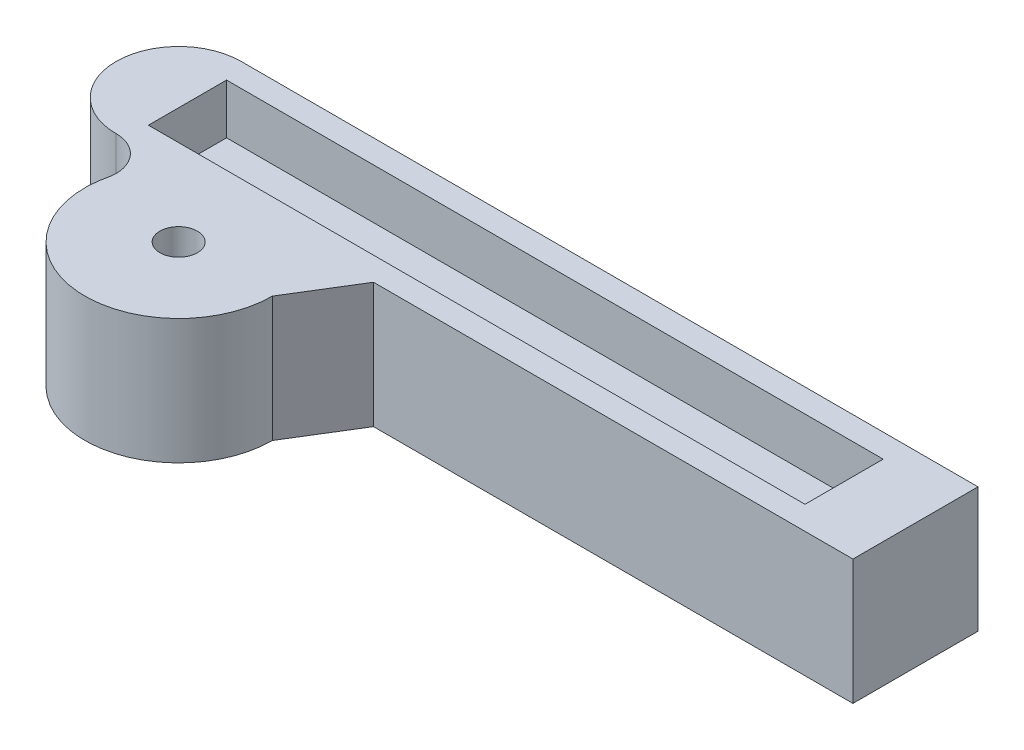
ISO-10303-21;
HEADER;
FILE_DESCRIPTION(('STEP AP214'),'2;1');
FILE_NAME('part.step','',(''),(''),'','','');
FILE_SCHEMA(('AUTOMOTIVE_DESIGN { 1 0 10303 214 1 1 1 1 }'));
ENDSEC;
DATA;
#1=APPLICATION_CONTEXT('core data for automotive mechanical design processes');
#2=APPLICATION_PROTOCOL_DEFINITION('international standard','automotive_design',2000,#1);
#3=PRODUCT_CONTEXT('',#1,'mechanical');
#4=PRODUCT('Part','Part','',(#3));
#5=PRODUCT_RELATED_PRODUCT_CATEGORY('part','',(#4));
#6=PRODUCT_DEFINITION_FORMATION('','',#4);
#7=PRODUCT_DEFINITION_CONTEXT('part definition',#1,'design');
#8=PRODUCT_DEFINITION('design','',#6,#7);
#9=PRODUCT_DEFINITION_SHAPE('','',#8);
#10=(LENGTH_UNIT() NAMED_UNIT(*) SI_UNIT(.MILLI.,.METRE.));
#11=(NAMED_UNIT(*) PLANE_ANGLE_UNIT() SI_UNIT($,.RADIAN.));
#12=(NAMED_UNIT(*) SI_UNIT($,.STERADIAN.) SOLID_ANGLE_UNIT());
#13=UNCERTAINTY_MEASURE_WITH_UNIT(LENGTH_MEASURE(1.E-05),#10,'distance_accuracy_value','');
#14=(GEOMETRIC_REPRESENTATION_CONTEXT(3) GLOBAL_UNCERTAINTY_ASSIGNED_CONTEXT((#13)) GLOBAL_UNIT_ASSIGNED_CONTEXT((#10,
#11,#12)) REPRESENTATION_CONTEXT('',''));
#15=CARTESIAN_POINT('',(0.,0.,0.));
#16=DIRECTION('',(0.,0.,1.));
#17=DIRECTION('',(1.,0.,0.));
#18=AXIS2_PLACEMENT_3D('',#15,#16,#17);
#19=CARTESIAN_POINT('',(-20.,20.,-4.47293048602591));
#20=DIRECTION('',(0.,-1.,0.));
#21=DIRECTION('',(0.,0.,-1.));
#22=AXIS2_PLACEMENT_3D('',#19,#20,#21);
#23=PLANE('',#22);
#24=DIRECTION('',(-1.,0.,0.));
#25=VECTOR('',#24,1.);
#26=CARTESIAN_POINT('',(-18.585,20.,-26.25));
#27=LINE('',#26,#25);
#28=CARTESIAN_POINT('',(86.415,20.,-26.25));
#29=VERTEX_POINT('',#28);
#30=CARTESIAN_POINT('',(-18.585,20.,-26.25));
#31=VERTEX_POINT('',#30);
#32=EDGE_CURVE('E172',#29,#31,#27,.T.);
#33=ORIENTED_EDGE('',*,*,#32,.F.);
#34=DIRECTION('',(0.,0.,-1.));
#35=VECTOR('',#34,1.);
#36=CARTESIAN_POINT('',(86.415,20.,-26.25));
#37=LINE('',#36,#35);
#38=CARTESIAN_POINT('',(86.415,20.,-13.75));
#39=VERTEX_POINT('',#38);
#40=EDGE_CURVE('E51',#39,#29,#37,.T.);
#41=ORIENTED_EDGE('',*,*,#40,.F.);
#42=DIRECTION('',(1.,0.,0.));
#43=VECTOR('',#42,1.);
#44=CARTESIAN_POINT('',(-18.585,20.,-13.75));
#45=LINE('',#44,#43);
#46=CARTESIAN_POINT('',(-18.585,20.,-13.75));
#47=VERTEX_POINT('',#46);
#48=EDGE_CURVE('E163',#47,#39,#45,.T.);
#49=ORIENTED_EDGE('',*,*,#48,.F.);
#50=DIRECTION('',(0.,0.,1.));
#51=VECTOR('',#50,1.);
#52=CARTESIAN_POINT('',(-18.585,20.,-26.25));
#53=LINE('',#52,#51);
#54=EDGE_CURVE('E166',#31,#47,#53,.T.);
#55=ORIENTED_EDGE('',*,*,#54,.F.);
#56=EDGE_LOOP('',(#33,#41,#49,#55));
#57=FACE_BOUND('',#56,.T.);
#58=CARTESIAN_POINT('',(-20.,20.,-4.47293048602591));
#59=DIRECTION('',(0.,-1.,0.));
#60=DIRECTION('',(0.,0.,-1.));
#61=AXIS2_PLACEMENT_3D('',#58,#59,#60);
#62=CIRCLE('',#61,5.52706951397407);
#63=CARTESIAN_POINT('',(-20.,20.,-10.));
#64=VERTEX_POINT('',#63);
#65=CARTESIAN_POINT('',(-14.5171381657611,20.,-3.77527475506122));
#66=VERTEX_POINT('',#65);
#67=EDGE_CURVE('E218',#64,#66,#62,.T.);
#68=ORIENTED_EDGE('',*,*,#67,.T.);
#69=CARTESIAN_POINT('',(0.,20.,0.));
#70=DIRECTION('',(0.,1.,0.));
#71=DIRECTION('',(0.,0.,1.));
#72=AXIS2_PLACEMENT_3D('',#69,#70,#71);
#73=CIRCLE('',#72,15.);
#74=CARTESIAN_POINT('',(15.,20.,0.));
#75=VERTEX_POINT('',#74);
#76=EDGE_CURVE('E221',#66,#75,#73,.T.);
#77=ORIENTED_EDGE('',*,*,#76,.T.);
#78=DIRECTION('',(0.524508299549326,0.,-0.85140533455216));
#79=VECTOR('',#78,1.);
#80=CARTESIAN_POINT('',(15.,20.,0.));
#81=LINE('',#80,#79);
#82=CARTESIAN_POINT('',(21.1605005073784,20.,-9.99999999999998));
#83=VERTEX_POINT('',#82);
#84=EDGE_CURVE('E224',#75,#83,#81,.T.);
#85=ORIENTED_EDGE('',*,*,#84,.T.);
#86=DIRECTION('',(1.,0.,0.));
#87=VECTOR('',#86,1.);
#88=CARTESIAN_POINT('',(97.83,20.,-10.));
#89=LINE('',#88,#87);
#90=CARTESIAN_POINT('',(97.83,20.,-10.));
#91=VERTEX_POINT('',#90);
#92=EDGE_CURVE('E226',#83,#91,#89,.T.);
#93=ORIENTED_EDGE('',*,*,#92,.T.);
#94=DIRECTION('',(0.,0.,-1.));
#95=VECTOR('',#94,1.);
#96=CARTESIAN_POINT('',(97.83,20.,-30.));
#97=LINE('',#96,#95);
#98=CARTESIAN_POINT('',(97.83,20.,-30.));
#99=VERTEX_POINT('',#98);
#100=EDGE_CURVE('E228',#91,#99,#97,.T.);
#101=ORIENTED_EDGE('',*,*,#100,.T.);
#102=DIRECTION('',(-1.,0.,0.));
#103=VECTOR('',#102,1.);
#104=CARTESIAN_POINT('',(-20.,20.,-30.));
#105=LINE('',#104,#103);
#106=CARTESIAN_POINT('',(-20.,20.,-30.));
#107=VERTEX_POINT('',#106);
#108=EDGE_CURVE('E230',#99,#107,#105,.T.);
#109=ORIENTED_EDGE('',*,*,#108,.T.);
#110=CARTESIAN_POINT('',(-20.,20.,-20.));
#111=DIRECTION('',(0.,1.,0.));
#112=DIRECTION('',(0.,0.,-1.));
#113=AXIS2_PLACEMENT_3D('',#110,#111,#112);
#114=CIRCLE('',#113,10.);
#115=EDGE_CURVE('E232',#107,#64,#114,.T.);
#116=ORIENTED_EDGE('',*,*,#115,.T.);
#117=EDGE_LOOP('',(#68,#77,#85,#93,#101,#109,#116));
#118=FACE_BOUND('',#117,.T.);
#119=CARTESIAN_POINT('',(0.,20.,0.));
#120=DIRECTION('',(0.,1.,0.));
#121=DIRECTION('',(0.,0.,1.));
#122=AXIS2_PLACEMENT_3D('',#119,#120,#121);
#123=CIRCLE('',#122,3.);
#124=CARTESIAN_POINT('',(0.,20.,3.));
#125=VERTEX_POINT('',#124);
#126=EDGE_CURVE('E212',#125,#125,#123,.T.);
#127=ORIENTED_EDGE('',*,*,#126,.F.);
#128=EDGE_LOOP('',(#127));
#129=FACE_BOUND('',#128,.T.);
#130=ADVANCED_FACE('F36',(#57,#118,#129),#23,.F.);
#131=CARTESIAN_POINT('',(-20.,0.,-4.47293048602591));
#132=DIRECTION('',(0.,-1.,0.));
#133=DIRECTION('',(0.,0.,-1.));
#134=AXIS2_PLACEMENT_3D('',#131,#132,#133);
#135=PLANE('',#134);
#136=DIRECTION('',(0.,0.,1.));
#137=VECTOR('',#136,1.);
#138=CARTESIAN_POINT('',(86.415,0.,-14.));
#139=LINE('',#138,#137);
#140=CARTESIAN_POINT('',(86.415,0.,-26.5));
#141=VERTEX_POINT('',#140);
#142=CARTESIAN_POINT('',(86.415,0.,-14.));
#143=VERTEX_POINT('',#142);
#144=EDGE_CURVE('E59',#141,#143,#139,.T.);
#145=ORIENTED_EDGE('',*,*,#144,.F.);
#146=DIRECTION('',(1.,0.,0.));
#147=VECTOR('',#146,1.);
#148=CARTESIAN_POINT('',(-18.585,0.,-26.5));
#149=LINE('',#148,#147);
#150=CARTESIAN_POINT('',(-18.585,0.,-26.5));
#151=VERTEX_POINT('',#150);
#152=EDGE_CURVE('E185',#151,#141,#149,.T.);
#153=ORIENTED_EDGE('',*,*,#152,.F.);
#154=DIRECTION('',(0.,0.,-1.));
#155=VECTOR('',#154,1.);
#156=CARTESIAN_POINT('',(-18.585,0.,-14.));
#157=LINE('',#156,#155);
#158=CARTESIAN_POINT('',(-18.585,0.,-14.));
#159=VERTEX_POINT('',#158);
#160=EDGE_CURVE('E199',#159,#151,#157,.T.);
#161=ORIENTED_EDGE('',*,*,#160,.F.);
#162=DIRECTION('',(-1.,0.,0.));
#163=VECTOR('',#162,1.);
#164=CARTESIAN_POINT('',(-18.585,0.,-14.));
#165=LINE('',#164,#163);
#166=EDGE_CURVE('E196',#143,#159,#165,.T.);
#167=ORIENTED_EDGE('',*,*,#166,.F.);
#168=EDGE_LOOP('',(#145,#153,#161,#167));
#169=FACE_BOUND('',#168,.T.);
#170=CARTESIAN_POINT('',(-20.,0.,-4.47293048602591));
#171=DIRECTION('',(0.,-1.,0.));
#172=DIRECTION('',(0.,0.,-1.));
#173=AXIS2_PLACEMENT_3D('',#170,#171,#172);
#174=CIRCLE('',#173,5.52706951397407);
#175=CARTESIAN_POINT('',(-20.,0.,-10.));
#176=VERTEX_POINT('',#175);
#177=CARTESIAN_POINT('',(-14.5171381657611,0.,-3.77527475506122));
#178=VERTEX_POINT('',#177);
#179=EDGE_CURVE('E215',#176,#178,#174,.T.);
#180=ORIENTED_EDGE('',*,*,#179,.F.);
#181=CARTESIAN_POINT('',(-20.,0.,-20.));
#182=DIRECTION('',(0.,1.,0.));
#183=DIRECTION('',(0.,0.,-1.));
#184=AXIS2_PLACEMENT_3D('',#181,#182,#183);
#185=CIRCLE('',#184,10.);
#186=CARTESIAN_POINT('',(-20.,0.,-30.));
#187=VERTEX_POINT('',#186);
#188=EDGE_CURVE('E222',#187,#176,#185,.T.);
#189=ORIENTED_EDGE('',*,*,#188,.F.);
#190=DIRECTION('',(-1.,0.,0.));
#191=VECTOR('',#190,1.);
#192=CARTESIAN_POINT('',(-20.,0.,-30.));
#193=LINE('',#192,#191);
#194=CARTESIAN_POINT('',(97.83,0.,-30.));
#195=VERTEX_POINT('',#194);
#196=EDGE_CURVE('E245',#195,#187,#193,.T.);
#197=ORIENTED_EDGE('',*,*,#196,.F.);
#198=DIRECTION('',(0.,0.,-1.));
#199=VECTOR('',#198,1.);
#200=CARTESIAN_POINT('',(97.83,0.,-30.));
#201=LINE('',#200,#199);
#202=CARTESIAN_POINT('',(97.83,0.,-10.));
#203=VERTEX_POINT('',#202);
#204=EDGE_CURVE('E243',#203,#195,#201,.T.);
#205=ORIENTED_EDGE('',*,*,#204,.F.);
#206=DIRECTION('',(1.,0.,0.));
#207=VECTOR('',#206,1.);
#208=CARTESIAN_POINT('',(97.83,0.,-10.));
#209=LINE('',#208,#207);
#210=CARTESIAN_POINT('',(21.1605005073784,0.,-9.99999999999998));
#211=VERTEX_POINT('',#210);
#212=EDGE_CURVE('E241',#211,#203,#209,.T.);
#213=ORIENTED_EDGE('',*,*,#212,.F.);
#214=DIRECTION('',(0.524508299549326,0.,-0.85140533455216));
#215=VECTOR('',#214,1.);
#216=CARTESIAN_POINT('',(15.,0.,0.));
#217=LINE('',#216,#215);
#218=CARTESIAN_POINT('',(15.,0.,0.));
#219=VERTEX_POINT('',#218);
#220=EDGE_CURVE('E239',#219,#211,#217,.T.);
#221=ORIENTED_EDGE('',*,*,#220,.F.);
#222=CARTESIAN_POINT('',(0.,0.,0.));
#223=DIRECTION('',(0.,1.,0.));
#224=DIRECTION('',(0.,0.,1.));
#225=AXIS2_PLACEMENT_3D('',#222,#223,#224);
#226=CIRCLE('',#225,15.);
#227=EDGE_CURVE('E237',#178,#219,#226,.T.);
#228=ORIENTED_EDGE('',*,*,#227,.F.);
#229=EDGE_LOOP('',(#180,#189,#197,#205,#213,#221,#228));
#230=FACE_BOUND('',#229,.T.);
#231=CARTESIAN_POINT('',(0.,0.,0.));
#232=DIRECTION('',(0.,1.,0.));
#233=DIRECTION('',(0.,0.,1.));
#234=AXIS2_PLACEMENT_3D('',#231,#232,#233);
#235=CIRCLE('',#234,3.);
#236=CARTESIAN_POINT('',(0.,0.,3.));
#237=VERTEX_POINT('',#236);
#238=EDGE_CURVE('E206',#237,#237,#235,.T.);
#239=ORIENTED_EDGE('',*,*,#238,.T.);
#240=EDGE_LOOP('',(#239));
#241=FACE_BOUND('',#240,.T.);
#242=ADVANCED_FACE('F272',(#169,#230,#241),#135,.T.);
#243=CARTESIAN_POINT('',(-20.,20.,-4.47293048602591));
#244=DIRECTION('',(0.,-1.,0.));
#245=DIRECTION('',(0.,0.,-1.));
#246=AXIS2_PLACEMENT_3D('',#243,#244,#245);
#247=CYLINDRICAL_SURFACE('',#246,5.52706951397407);
#248=ORIENTED_EDGE('',*,*,#179,.T.);
#249=DIRECTION('',(0.,-1.,0.));
#250=VECTOR('',#249,1.);
#251=CARTESIAN_POINT('',(-14.5171381657611,20.,-3.77527475506122));
#252=LINE('',#251,#250);
#253=EDGE_CURVE('E11',#66,#178,#252,.T.);
#254=ORIENTED_EDGE('',*,*,#253,.F.);
#255=ORIENTED_EDGE('',*,*,#67,.F.);
#256=DIRECTION('',(0.,-1.,0.));
#257=VECTOR('',#256,1.);
#258=CARTESIAN_POINT('',(-20.,20.,-10.));
#259=LINE('',#258,#257);
#260=EDGE_CURVE('E234',#64,#176,#259,.T.);
#261=ORIENTED_EDGE('',*,*,#260,.T.);
#262=EDGE_LOOP('',(#248,#254,#255,#261));
#263=FACE_BOUND('',#262,.T.);
#264=ADVANCED_FACE('F38',(#263),#247,.F.);
#265=CARTESIAN_POINT('',(0.,20.,0.));
#266=DIRECTION('',(0.,-1.,0.));
#267=DIRECTION('',(0.,0.,-1.));
#268=AXIS2_PLACEMENT_3D('',#265,#266,#267);
#269=CYLINDRICAL_SURFACE('',#268,15.);
#270=ORIENTED_EDGE('',*,*,#227,.T.);
#271=DIRECTION('',(0.,-1.,0.));
#272=VECTOR('',#271,1.);
#273=CARTESIAN_POINT('',(15.,20.,0.));
#274=LINE('',#273,#272);
#275=EDGE_CURVE('E44',#75,#219,#274,.T.);
#276=ORIENTED_EDGE('',*,*,#275,.F.);
#277=ORIENTED_EDGE('',*,*,#76,.F.);
#278=ORIENTED_EDGE('',*,*,#253,.T.);
#279=EDGE_LOOP('',(#270,#276,#277,#278));
#280=FACE_BOUND('',#279,.T.);
#281=ADVANCED_FACE('F290',(#280),#269,.T.);
#282=CARTESIAN_POINT('',(15.,20.,0.));
#283=DIRECTION('',(-0.85140533455216,0.,-0.524508299549326));
#284=DIRECTION('',(-0.524508299549326,0.,0.85140533455216));
#285=AXIS2_PLACEMENT_3D('',#282,#283,#284);
#286=PLANE('',#285);
#287=ORIENTED_EDGE('',*,*,#220,.T.);
#288=DIRECTION('',(0.,-1.,0.));
#289=VECTOR('',#288,1.);
#290=CARTESIAN_POINT('',(21.1605005073784,20.,-9.99999999999998));
#291=LINE('',#290,#289);
#292=EDGE_CURVE('E259',#83,#211,#291,.T.);
#293=ORIENTED_EDGE('',*,*,#292,.F.);
#294=ORIENTED_EDGE('',*,*,#84,.F.);
#295=ORIENTED_EDGE('',*,*,#275,.T.);
#296=EDGE_LOOP('',(#287,#293,#294,#295));
#297=FACE_BOUND('',#296,.T.);
#298=ADVANCED_FACE('F266',(#297),#286,.F.);
#299=CARTESIAN_POINT('',(97.83,20.,-10.));
#300=DIRECTION('',(0.,0.,-1.));
#301=DIRECTION('',(-1.,0.,0.));
#302=AXIS2_PLACEMENT_3D('',#299,#300,#301);
#303=PLANE('',#302);
#304=ORIENTED_EDGE('',*,*,#212,.T.);
#305=DIRECTION('',(0.,-1.,0.));
#306=VECTOR('',#305,1.);
#307=CARTESIAN_POINT('',(97.83,20.,-10.));
#308=LINE('',#307,#306);
#309=EDGE_CURVE('E256',#91,#203,#308,.T.);
#310=ORIENTED_EDGE('',*,*,#309,.F.);
#311=ORIENTED_EDGE('',*,*,#92,.F.);
#312=ORIENTED_EDGE('',*,*,#292,.T.);
#313=EDGE_LOOP('',(#304,#310,#311,#312));
#314=FACE_BOUND('',#313,.T.);
#315=ADVANCED_FACE('F278',(#314),#303,.F.);
#316=CARTESIAN_POINT('',(97.83,20.,-30.));
#317=DIRECTION('',(-1.,0.,0.));
#318=DIRECTION('',(0.,0.,1.));
#319=AXIS2_PLACEMENT_3D('',#316,#317,#318);
#320=PLANE('',#319);
#321=ORIENTED_EDGE('',*,*,#204,.T.);
#322=DIRECTION('',(0.,-1.,0.));
#323=VECTOR('',#322,1.);
#324=CARTESIAN_POINT('',(97.83,20.,-30.));
#325=LINE('',#324,#323);
#326=EDGE_CURVE('E253',#99,#195,#325,.T.);
#327=ORIENTED_EDGE('',*,*,#326,.F.);
#328=ORIENTED_EDGE('',*,*,#100,.F.);
#329=ORIENTED_EDGE('',*,*,#309,.T.);
#330=EDGE_LOOP('',(#321,#327,#328,#329));
#331=FACE_BOUND('',#330,.T.);
#332=ADVANCED_FACE('F282',(#331),#320,.F.);
#333=CARTESIAN_POINT('',(-20.,20.,-30.));
#334=DIRECTION('',(0.,0.,1.));
#335=DIRECTION('',(1.,0.,0.));
#336=AXIS2_PLACEMENT_3D('',#333,#334,#335);
#337=PLANE('',#336);
#338=ORIENTED_EDGE('',*,*,#196,.T.);
#339=DIRECTION('',(0.,-1.,0.));
#340=VECTOR('',#339,1.);
#341=CARTESIAN_POINT('',(-20.,20.,-30.));
#342=LINE('',#341,#340);
#343=EDGE_CURVE('E250',#107,#187,#342,.T.);
#344=ORIENTED_EDGE('',*,*,#343,.F.);
#345=ORIENTED_EDGE('',*,*,#108,.F.);
#346=ORIENTED_EDGE('',*,*,#326,.T.);
#347=EDGE_LOOP('',(#338,#344,#345,#346));
#348=FACE_BOUND('',#347,.T.);
#349=ADVANCED_FACE('F298',(#348),#337,.F.);
#350=CARTESIAN_POINT('',(-20.,20.,-20.));
#351=DIRECTION('',(0.,-1.,0.));
#352=DIRECTION('',(0.,0.,-1.));
#353=AXIS2_PLACEMENT_3D('',#350,#351,#352);
#354=CYLINDRICAL_SURFACE('',#353,10.);
#355=ORIENTED_EDGE('',*,*,#188,.T.);
#356=ORIENTED_EDGE('',*,*,#260,.F.);
#357=ORIENTED_EDGE('',*,*,#115,.F.);
#358=ORIENTED_EDGE('',*,*,#343,.T.);
#359=EDGE_LOOP('',(#355,#356,#357,#358));
#360=FACE_BOUND('',#359,.T.);
#361=ADVANCED_FACE('F295',(#360),#354,.T.);
#362=CARTESIAN_POINT('',(0.,20.,0.));
#363=DIRECTION('',(0.,-1.,0.));
#364=DIRECTION('',(0.,0.,-1.));
#365=AXIS2_PLACEMENT_3D('',#362,#363,#364);
#366=CYLINDRICAL_SURFACE('',#365,3.);
#367=ORIENTED_EDGE('',*,*,#126,.T.);
#368=EDGE_LOOP('',(#367));
#369=FACE_BOUND('',#368,.T.);
#370=ORIENTED_EDGE('',*,*,#238,.F.);
#371=EDGE_LOOP('',(#370));
#372=FACE_BOUND('',#371,.T.);
#373=ADVANCED_FACE('F305',(#369,#372),#366,.F.);
#374=CARTESIAN_POINT('',(86.415,8.,-14.));
#375=DIRECTION('',(1.,0.,0.));
#376=DIRECTION('',(0.,0.,-1.));
#377=AXIS2_PLACEMENT_3D('',#374,#375,#376);
#378=PLANE('',#377);
#379=ORIENTED_EDGE('',*,*,#144,.T.);
#380=DIRECTION('',(0.,-1.,0.));
#381=VECTOR('',#380,1.);
#382=CARTESIAN_POINT('',(86.415,8.,-14.));
#383=LINE('',#382,#381);
#384=CARTESIAN_POINT('',(86.415,8.,-14.));
#385=VERTEX_POINT('',#384);
#386=EDGE_CURVE('E194',#385,#143,#383,.T.);
#387=ORIENTED_EDGE('',*,*,#386,.F.);
#388=DIRECTION('',(0.,0.,1.));
#389=VECTOR('',#388,1.);
#390=CARTESIAN_POINT('',(86.415,8.,-14.));
#391=LINE('',#390,#389);
#392=CARTESIAN_POINT('',(86.415,8.,-26.5));
#393=VERTEX_POINT('',#392);
#394=EDGE_CURVE('E181',#393,#385,#391,.T.);
#395=ORIENTED_EDGE('',*,*,#394,.F.);
#396=DIRECTION('',(0.,-1.,0.));
#397=VECTOR('',#396,1.);
#398=CARTESIAN_POINT('',(86.415,8.,-26.5));
#399=LINE('',#398,#397);
#400=EDGE_CURVE('E204',#393,#141,#399,.T.);
#401=ORIENTED_EDGE('',*,*,#400,.T.);
#402=EDGE_LOOP('',(#379,#387,#395,#401));
#403=FACE_BOUND('',#402,.T.);
#404=ADVANCED_FACE('F319',(#403),#378,.F.);
#405=CARTESIAN_POINT('',(-18.585,8.,-26.5));
#406=DIRECTION('',(0.,0.,-1.));
#407=DIRECTION('',(-1.,0.,0.));
#408=AXIS2_PLACEMENT_3D('',#405,#406,#407);
#409=PLANE('',#408);
#410=ORIENTED_EDGE('',*,*,#152,.T.);
#411=ORIENTED_EDGE('',*,*,#400,.F.);
#412=DIRECTION('',(1.,0.,0.));
#413=VECTOR('',#412,1.);
#414=CARTESIAN_POINT('',(-18.585,8.,-26.5));
#415=LINE('',#414,#413);
#416=CARTESIAN_POINT('',(-18.585,8.,-26.5));
#417=VERTEX_POINT('',#416);
#418=EDGE_CURVE('E191',#417,#393,#415,.T.);
#419=ORIENTED_EDGE('',*,*,#418,.F.);
#420=DIRECTION('',(0.,-1.,0.));
#421=VECTOR('',#420,1.);
#422=CARTESIAN_POINT('',(-18.585,8.,-26.5));
#423=LINE('',#422,#421);
#424=EDGE_CURVE('E207',#417,#151,#423,.T.);
#425=ORIENTED_EDGE('',*,*,#424,.T.);
#426=EDGE_LOOP('',(#410,#411,#419,#425));
#427=FACE_BOUND('',#426,.T.);
#428=ADVANCED_FACE('F323',(#427),#409,.F.);
#429=CARTESIAN_POINT('',(-18.585,8.,-14.));
#430=DIRECTION('',(-1.,0.,0.));
#431=DIRECTION('',(0.,0.,1.));
#432=AXIS2_PLACEMENT_3D('',#429,#430,#431);
#433=PLANE('',#432);
#434=ORIENTED_EDGE('',*,*,#160,.T.);
#435=ORIENTED_EDGE('',*,*,#424,.F.);
#436=DIRECTION('',(0.,0.,-1.));
#437=VECTOR('',#436,1.);
#438=CARTESIAN_POINT('',(-18.585,8.,-14.));
#439=LINE('',#438,#437);
#440=CARTESIAN_POINT('',(-18.585,8.,-14.));
#441=VERTEX_POINT('',#440);
#442=EDGE_CURVE('E188',#441,#417,#439,.T.);
#443=ORIENTED_EDGE('',*,*,#442,.F.);
#444=DIRECTION('',(0.,-1.,0.));
#445=VECTOR('',#444,1.);
#446=CARTESIAN_POINT('',(-18.585,8.,-14.));
#447=LINE('',#446,#445);
#448=EDGE_CURVE('E209',#441,#159,#447,.T.);
#449=ORIENTED_EDGE('',*,*,#448,.T.);
#450=EDGE_LOOP('',(#434,#435,#443,#449));
#451=FACE_BOUND('',#450,.T.);
#452=ADVANCED_FACE('F328',(#451),#433,.F.);
#453=CARTESIAN_POINT('',(-18.585,8.,-14.));
#454=DIRECTION('',(0.,0.,1.));
#455=DIRECTION('',(1.,0.,0.));
#456=AXIS2_PLACEMENT_3D('',#453,#454,#455);
#457=PLANE('',#456);
#458=ORIENTED_EDGE('',*,*,#166,.T.);
#459=ORIENTED_EDGE('',*,*,#448,.F.);
#460=DIRECTION('',(-1.,0.,0.));
#461=VECTOR('',#460,1.);
#462=CARTESIAN_POINT('',(-18.585,8.,-14.));
#463=LINE('',#462,#461);
#464=EDGE_CURVE('E184',#385,#441,#463,.T.);
#465=ORIENTED_EDGE('',*,*,#464,.F.);
#466=ORIENTED_EDGE('',*,*,#386,.T.);
#467=EDGE_LOOP('',(#458,#459,#465,#466));
#468=FACE_BOUND('',#467,.T.);
#469=ADVANCED_FACE('F324',(#468),#457,.F.);
#470=CARTESIAN_POINT('',(0.,8.,0.));
#471=DIRECTION('',(0.,-1.,0.));
#472=DIRECTION('',(0.,0.,-1.));
#473=AXIS2_PLACEMENT_3D('',#470,#471,#472);
#474=PLANE('',#473);
#475=ORIENTED_EDGE('',*,*,#394,.T.);
#476=ORIENTED_EDGE('',*,*,#464,.T.);
#477=ORIENTED_EDGE('',*,*,#442,.T.);
#478=ORIENTED_EDGE('',*,*,#418,.T.);
#479=EDGE_LOOP('',(#475,#476,#477,#478));
#480=FACE_BOUND('',#479,.T.);
#481=ADVANCED_FACE('F327',(#480),#474,.T.);
#482=CARTESIAN_POINT('',(86.415,12.,-26.25));
#483=DIRECTION('',(1.,0.,0.));
#484=DIRECTION('',(0.,0.,-1.));
#485=AXIS2_PLACEMENT_3D('',#482,#483,#484);
#486=PLANE('',#485);
#487=ORIENTED_EDGE('',*,*,#40,.T.);
#488=DIRECTION('',(0.,1.,0.));
#489=VECTOR('',#488,1.);
#490=CARTESIAN_POINT('',(86.415,12.,-26.25));
#491=LINE('',#490,#489);
#492=CARTESIAN_POINT('',(86.415,12.,-26.25));
#493=VERTEX_POINT('',#492);
#494=EDGE_CURVE('E141',#493,#29,#491,.T.);
#495=ORIENTED_EDGE('',*,*,#494,.F.);
#496=DIRECTION('',(0.,0.,-1.));
#497=VECTOR('',#496,1.);
#498=CARTESIAN_POINT('',(86.415,12.,-26.25));
#499=LINE('',#498,#497);
#500=CARTESIAN_POINT('',(86.415,12.,-13.75));
#501=VERTEX_POINT('',#500);
#502=EDGE_CURVE('E145',#501,#493,#499,.T.);
#503=ORIENTED_EDGE('',*,*,#502,.F.);
#504=DIRECTION('',(0.,1.,0.));
#505=VECTOR('',#504,1.);
#506=CARTESIAN_POINT('',(86.415,12.,-13.75));
#507=LINE('',#506,#505);
#508=EDGE_CURVE('E176',#501,#39,#507,.T.);
#509=ORIENTED_EDGE('',*,*,#508,.T.);
#510=EDGE_LOOP('',(#487,#495,#503,#509));
#511=FACE_BOUND('',#510,.T.);
#512=ADVANCED_FACE('F143',(#511),#486,.F.);
#513=CARTESIAN_POINT('',(-18.585,12.,-13.75));
#514=DIRECTION('',(0.,0.,1.));
#515=DIRECTION('',(1.,0.,0.));
#516=AXIS2_PLACEMENT_3D('',#513,#514,#515);
#517=PLANE('',#516);
#518=ORIENTED_EDGE('',*,*,#48,.T.);
#519=ORIENTED_EDGE('',*,*,#508,.F.);
#520=DIRECTION('',(1.,0.,0.));
#521=VECTOR('',#520,1.);
#522=CARTESIAN_POINT('',(-18.585,12.,-13.75));
#523=LINE('',#522,#521);
#524=CARTESIAN_POINT('',(-18.585,12.,-13.75));
#525=VERTEX_POINT('',#524);
#526=EDGE_CURVE('E151',#525,#501,#523,.T.);
#527=ORIENTED_EDGE('',*,*,#526,.F.);
#528=DIRECTION('',(0.,1.,0.));
#529=VECTOR('',#528,1.);
#530=CARTESIAN_POINT('',(-18.585,12.,-13.75));
#531=LINE('',#530,#529);
#532=EDGE_CURVE('E178',#525,#47,#531,.T.);
#533=ORIENTED_EDGE('',*,*,#532,.T.);
#534=EDGE_LOOP('',(#518,#519,#527,#533));
#535=FACE_BOUND('',#534,.T.);
#536=ADVANCED_FACE('F341',(#535),#517,.F.);
#537=CARTESIAN_POINT('',(-18.585,12.,-26.25));
#538=DIRECTION('',(-1.,0.,0.));
#539=DIRECTION('',(0.,0.,1.));
#540=AXIS2_PLACEMENT_3D('',#537,#538,#539);
#541=PLANE('',#540);
#542=ORIENTED_EDGE('',*,*,#54,.T.);
#543=ORIENTED_EDGE('',*,*,#532,.F.);
#544=DIRECTION('',(0.,0.,1.));
#545=VECTOR('',#544,1.);
#546=CARTESIAN_POINT('',(-18.585,12.,-26.25));
#547=LINE('',#546,#545);
#548=CARTESIAN_POINT('',(-18.585,12.,-26.25));
#549=VERTEX_POINT('',#548);
#550=EDGE_CURVE('E159',#549,#525,#547,.T.);
#551=ORIENTED_EDGE('',*,*,#550,.F.);
#552=DIRECTION('',(0.,1.,0.));
#553=VECTOR('',#552,1.);
#554=CARTESIAN_POINT('',(-18.585,12.,-26.25));
#555=LINE('',#554,#553);
#556=EDGE_CURVE('E150',#549,#31,#555,.T.);
#557=ORIENTED_EDGE('',*,*,#556,.T.);
#558=EDGE_LOOP('',(#542,#543,#551,#557));
#559=FACE_BOUND('',#558,.T.);
#560=ADVANCED_FACE('F344',(#559),#541,.F.);
#561=CARTESIAN_POINT('',(-18.585,12.,-26.25));
#562=DIRECTION('',(0.,0.,-1.));
#563=DIRECTION('',(-1.,0.,0.));
#564=AXIS2_PLACEMENT_3D('',#561,#562,#563);
#565=PLANE('',#564);
#566=ORIENTED_EDGE('',*,*,#32,.T.);
#567=ORIENTED_EDGE('',*,*,#556,.F.);
#568=DIRECTION('',(-1.,0.,0.));
#569=VECTOR('',#568,1.);
#570=CARTESIAN_POINT('',(-18.585,12.,-26.25));
#571=LINE('',#570,#569);
#572=EDGE_CURVE('E154',#493,#549,#571,.T.);
#573=ORIENTED_EDGE('',*,*,#572,.F.);
#574=ORIENTED_EDGE('',*,*,#494,.T.);
#575=EDGE_LOOP('',(#566,#567,#573,#574));
#576=FACE_BOUND('',#575,.T.);
#577=ADVANCED_FACE('F155',(#576),#565,.F.);
#578=CARTESIAN_POINT('',(0.,12.,0.));
#579=DIRECTION('',(0.,1.,0.));
#580=DIRECTION('',(0.,0.,1.));
#581=AXIS2_PLACEMENT_3D('',#578,#579,#580);
#582=PLANE('',#581);
#583=ORIENTED_EDGE('',*,*,#502,.T.);
#584=ORIENTED_EDGE('',*,*,#572,.T.);
#585=ORIENTED_EDGE('',*,*,#550,.T.);
#586=ORIENTED_EDGE('',*,*,#526,.T.);
#587=EDGE_LOOP('',(#583,#584,#585,#586));
#588=FACE_BOUND('',#587,.T.);
#589=ADVANCED_FACE('F161',(#588),#582,.T.);
#590=CLOSED_SHELL('',(#130,#242,#264,#281,#298,#315,#332,#349,#361,#373,#404,#428,#452,#469,
#481,#512,#536,#560,#577,#589));
#591=MANIFOLD_SOLID_BREP('B2',#590);
#592=ADVANCED_BREP_SHAPE_REPRESENTATION('',(#18,#591),#14);
#593=SHAPE_DEFINITION_REPRESENTATION(#9,#592);
ENDSEC;
END-ISO-10303-21;
